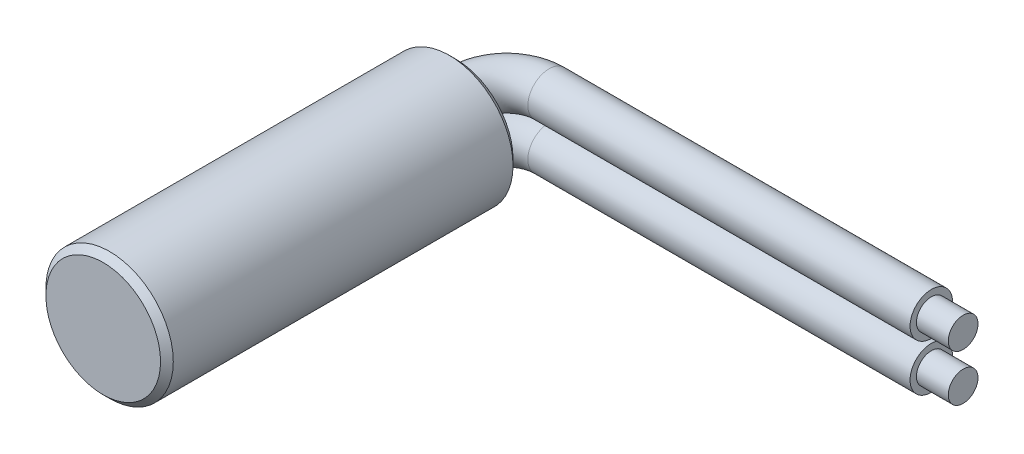
ISO-10303-21;
HEADER;
FILE_DESCRIPTION(('STEP AP214'),'2;1');
FILE_NAME('part.step','',(''),(''),'','','');
FILE_SCHEMA(('AUTOMOTIVE_DESIGN { 1 0 10303 214 1 1 1 1 }'));
ENDSEC;
DATA;
#1=APPLICATION_CONTEXT('core data for automotive mechanical design processes');
#2=APPLICATION_PROTOCOL_DEFINITION('international standard','automotive_design',2000,#1);
#3=PRODUCT_CONTEXT('',#1,'mechanical');
#4=PRODUCT('Part','Part','',(#3));
#5=PRODUCT_RELATED_PRODUCT_CATEGORY('part','',(#4));
#6=PRODUCT_DEFINITION_FORMATION('','',#4);
#7=PRODUCT_DEFINITION_CONTEXT('part definition',#1,'design');
#8=PRODUCT_DEFINITION('design','',#6,#7);
#9=PRODUCT_DEFINITION_SHAPE('','',#8);
#10=(LENGTH_UNIT() NAMED_UNIT(*) SI_UNIT(.MILLI.,.METRE.));
#11=(NAMED_UNIT(*) PLANE_ANGLE_UNIT() SI_UNIT($,.RADIAN.));
#12=(NAMED_UNIT(*) SI_UNIT($,.STERADIAN.) SOLID_ANGLE_UNIT());
#13=UNCERTAINTY_MEASURE_WITH_UNIT(LENGTH_MEASURE(1.E-05),#10,'distance_accuracy_value','');
#14=(GEOMETRIC_REPRESENTATION_CONTEXT(3) GLOBAL_UNCERTAINTY_ASSIGNED_CONTEXT((#13)) GLOBAL_UNIT_ASSIGNED_CONTEXT((#10,
#11,#12)) REPRESENTATION_CONTEXT('',''));
#15=CARTESIAN_POINT('',(0.,0.,0.));
#16=DIRECTION('',(0.,0.,1.));
#17=DIRECTION('',(1.,0.,0.));
#18=AXIS2_PLACEMENT_3D('',#15,#16,#17);
#19=CARTESIAN_POINT('',(0.,0.,16.6));
#20=DIRECTION('',(0.,0.,-1.));
#21=DIRECTION('',(-1.,0.,0.));
#22=AXIS2_PLACEMENT_3D('',#19,#20,#21);
#23=CYLINDRICAL_SURFACE('',#22,3.);
#24=CARTESIAN_POINT('',(0.,0.,0.300000000000009));
#25=DIRECTION('',(0.,0.,1.));
#26=DIRECTION('',(1.,0.,0.));
#27=AXIS2_PLACEMENT_3D('',#24,#25,#26);
#28=CIRCLE('',#27,3.);
#29=CARTESIAN_POINT('',(3.,0.,0.300000000000009));
#30=VERTEX_POINT('',#29);
#31=EDGE_CURVE('E77',#30,#30,#28,.T.);
#32=ORIENTED_EDGE('',*,*,#31,.T.);
#33=EDGE_LOOP('',(#32));
#34=FACE_BOUND('',#33,.T.);
#35=CARTESIAN_POINT('',(0.,0.,16.3));
#36=DIRECTION('',(0.,0.,1.));
#37=DIRECTION('',(1.,0.,0.));
#38=AXIS2_PLACEMENT_3D('',#35,#36,#37);
#39=CIRCLE('',#38,3.);
#40=CARTESIAN_POINT('',(3.,0.,16.3));
#41=VERTEX_POINT('',#40);
#42=EDGE_CURVE('E74',#41,#41,#39,.F.);
#43=ORIENTED_EDGE('',*,*,#42,.T.);
#44=EDGE_LOOP('',(#43));
#45=FACE_BOUND('',#44,.T.);
#46=ADVANCED_FACE('F35',(#34,#45),#23,.T.);
#47=CARTESIAN_POINT('',(0.,0.,16.6));
#48=DIRECTION('',(0.,0.,1.));
#49=DIRECTION('',(1.,0.,0.));
#50=AXIS2_PLACEMENT_3D('',#47,#48,#49);
#51=PLANE('',#50);
#52=CARTESIAN_POINT('',(0.,0.,16.6));
#53=DIRECTION('',(0.,0.,1.));
#54=DIRECTION('',(1.,0.,0.));
#55=AXIS2_PLACEMENT_3D('',#52,#53,#54);
#56=CIRCLE('',#55,2.70000000000001);
#57=CARTESIAN_POINT('',(2.70000000000001,0.,16.6));
#58=VERTEX_POINT('',#57);
#59=EDGE_CURVE('E39',#58,#58,#56,.T.);
#60=ORIENTED_EDGE('',*,*,#59,.T.);
#61=EDGE_LOOP('',(#60));
#62=FACE_BOUND('',#61,.T.);
#63=ADVANCED_FACE('F110',(#62),#51,.T.);
#64=CARTESIAN_POINT('',(0.,0.,0.));
#65=DIRECTION('',(0.,0.,1.));
#66=DIRECTION('',(1.,0.,0.));
#67=AXIS2_PLACEMENT_3D('',#64,#65,#66);
#68=PLANE('',#67);
#69=CARTESIAN_POINT('',(0.,1.1,0.));
#70=DIRECTION('',(0.,0.,-1.));
#71=DIRECTION('',(-1.,0.,0.));
#72=AXIS2_PLACEMENT_3D('',#69,#70,#71);
#73=CIRCLE('',#72,1.);
#74=CARTESIAN_POINT('',(-1.,1.1,0.));
#75=VERTEX_POINT('',#74);
#76=EDGE_CURVE('E93',#75,#75,#73,.T.);
#77=ORIENTED_EDGE('',*,*,#76,.F.);
#78=EDGE_LOOP('',(#77));
#79=FACE_BOUND('',#78,.T.);
#80=CARTESIAN_POINT('',(0.,-1.1,0.));
#81=DIRECTION('',(0.,0.,-1.));
#82=DIRECTION('',(-1.,0.,0.));
#83=AXIS2_PLACEMENT_3D('',#80,#81,#82);
#84=CIRCLE('',#83,1.);
#85=CARTESIAN_POINT('',(-1.,-1.1,0.));
#86=VERTEX_POINT('',#85);
#87=EDGE_CURVE('E57',#86,#86,#84,.T.);
#88=ORIENTED_EDGE('',*,*,#87,.F.);
#89=EDGE_LOOP('',(#88));
#90=FACE_BOUND('',#89,.T.);
#91=CARTESIAN_POINT('',(0.,0.,0.));
#92=DIRECTION('',(0.,0.,1.));
#93=DIRECTION('',(1.,0.,0.));
#94=AXIS2_PLACEMENT_3D('',#91,#92,#93);
#95=CIRCLE('',#94,2.69999999999999);
#96=CARTESIAN_POINT('',(2.69999999999999,0.,0.));
#97=VERTEX_POINT('',#96);
#98=EDGE_CURVE('E79',#97,#97,#95,.F.);
#99=ORIENTED_EDGE('',*,*,#98,.T.);
#100=EDGE_LOOP('',(#99));
#101=FACE_BOUND('',#100,.T.);
#102=ADVANCED_FACE('F106',(#79,#90,#101),#68,.F.);
#103=CARTESIAN_POINT('',(0.,0.,0.300000000000009));
#104=DIRECTION('',(0.,0.,1.));
#105=DIRECTION('',(1.,0.,0.));
#106=AXIS2_PLACEMENT_3D('',#103,#104,#105);
#107=CONICAL_SURFACE('',#106,3.,0.785398163397454);
#108=ORIENTED_EDGE('',*,*,#98,.F.);
#109=EDGE_LOOP('',(#108));
#110=FACE_BOUND('',#109,.T.);
#111=ORIENTED_EDGE('',*,*,#31,.F.);
#112=EDGE_LOOP('',(#111));
#113=FACE_BOUND('',#112,.T.);
#114=ADVANCED_FACE('F109',(#110,#113),#107,.T.);
#115=CARTESIAN_POINT('',(0.,0.,16.6));
#116=DIRECTION('',(0.,0.,-1.));
#117=DIRECTION('',(-1.,0.,0.));
#118=AXIS2_PLACEMENT_3D('',#115,#116,#117);
#119=CONICAL_SURFACE('',#118,2.70000000000001,0.785398163397443);
#120=ORIENTED_EDGE('',*,*,#42,.F.);
#121=EDGE_LOOP('',(#120));
#122=FACE_BOUND('',#121,.T.);
#123=ORIENTED_EDGE('',*,*,#59,.F.);
#124=EDGE_LOOP('',(#123));
#125=FACE_BOUND('',#124,.T.);
#126=ADVANCED_FACE('F37',(#122,#125),#119,.T.);
#127=CARTESIAN_POINT('',(20.,-1.1,-2.4));
#128=DIRECTION('',(1.,0.,0.));
#129=DIRECTION('',(0.,0.,-1.));
#130=AXIS2_PLACEMENT_3D('',#127,#128,#129);
#131=PLANE('',#130);
#132=CARTESIAN_POINT('',(20.,-1.1,-2.4));
#133=DIRECTION('',(1.,0.,0.));
#134=DIRECTION('',(0.,0.,-1.));
#135=AXIS2_PLACEMENT_3D('',#132,#133,#134);
#136=CIRCLE('',#135,0.7);
#137=CARTESIAN_POINT('',(20.,-1.1,-3.1));
#138=VERTEX_POINT('',#137);
#139=EDGE_CURVE('E11',#138,#138,#136,.T.);
#140=ORIENTED_EDGE('',*,*,#139,.F.);
#141=EDGE_LOOP('',(#140));
#142=FACE_BOUND('',#141,.T.);
#143=CARTESIAN_POINT('',(20.,-1.1,-2.4));
#144=DIRECTION('',(1.,0.,0.));
#145=DIRECTION('',(0.,0.,-1.));
#146=AXIS2_PLACEMENT_3D('',#143,#144,#145);
#147=CIRCLE('',#146,1.);
#148=CARTESIAN_POINT('',(20.,-1.1,-3.4));
#149=VERTEX_POINT('',#148);
#150=EDGE_CURVE('E50',#149,#149,#147,.T.);
#151=ORIENTED_EDGE('',*,*,#150,.T.);
#152=EDGE_LOOP('',(#151));
#153=FACE_BOUND('',#152,.T.);
#154=ADVANCED_FACE('F117',(#142,#153),#131,.T.);
#155=CARTESIAN_POINT('',(0.,-1.1,0.));
#156=DIRECTION('',(0.,0.,-1.));
#157=DIRECTION('',(-1.,0.,0.));
#158=AXIS2_PLACEMENT_3D('',#155,#156,#157);
#159=CYLINDRICAL_SURFACE('',#158,1.);
#160=CARTESIAN_POINT('',(0.,-1.1,-0.4));
#161=DIRECTION('',(0.,0.,-1.));
#162=DIRECTION('',(-1.,0.,0.));
#163=AXIS2_PLACEMENT_3D('',#160,#161,#162);
#164=CIRCLE('',#163,1.);
#165=CARTESIAN_POINT('',(-1.,-1.1,-0.4));
#166=VERTEX_POINT('',#165);
#167=EDGE_CURVE('E61',#166,#166,#164,.T.);
#168=ORIENTED_EDGE('',*,*,#167,.F.);
#169=EDGE_LOOP('',(#168));
#170=FACE_BOUND('',#169,.T.);
#171=ORIENTED_EDGE('',*,*,#87,.T.);
#172=EDGE_LOOP('',(#171));
#173=FACE_BOUND('',#172,.T.);
#174=ADVANCED_FACE('F114',(#170,#173),#159,.T.);
#175=CARTESIAN_POINT('',(2.,-1.1,-0.4));
#176=DIRECTION('',(0.,-1.,0.));
#177=DIRECTION('',(0.,0.,-1.));
#178=AXIS2_PLACEMENT_3D('',#175,#176,#177);
#179=TOROIDAL_SURFACE('',#178,2.,1.);
#180=CARTESIAN_POINT('',(2.,-1.1,-2.4));
#181=DIRECTION('',(1.,0.,0.));
#182=DIRECTION('',(0.,0.,-1.));
#183=AXIS2_PLACEMENT_3D('',#180,#181,#182);
#184=CIRCLE('',#183,1.);
#185=CARTESIAN_POINT('',(2.,-1.1,-3.4));
#186=VERTEX_POINT('',#185);
#187=EDGE_CURVE('E70',#186,#186,#184,.T.);
#188=CARTESIAN_POINT('',(2.,-1.1,-0.4));
#189=DIRECTION('',(0.,-1.,0.));
#190=DIRECTION('',(0.,0.,-1.));
#191=AXIS2_PLACEMENT_3D('',#188,#189,#190);
#192=CIRCLE('',#191,3.);
#193=EDGE_CURVE('',#166,#186,#192,.T.);
#194=ORIENTED_EDGE('',*,*,#167,.T.);
#195=ORIENTED_EDGE('',*,*,#187,.F.);
#196=ORIENTED_EDGE('',*,*,#193,.T.);
#197=ORIENTED_EDGE('',*,*,#193,.F.);
#198=EDGE_LOOP('',(#194,#196,#195,#197));
#199=FACE_BOUND('',#198,.T.);
#200=ADVANCED_FACE('F116',(#199),#179,.T.);
#201=CARTESIAN_POINT('',(2.,-1.1,-2.4));
#202=DIRECTION('',(1.,0.,0.));
#203=DIRECTION('',(0.,0.,-1.));
#204=AXIS2_PLACEMENT_3D('',#201,#202,#203);
#205=CYLINDRICAL_SURFACE('',#204,1.);
#206=ORIENTED_EDGE('',*,*,#150,.F.);
#207=EDGE_LOOP('',(#206));
#208=FACE_BOUND('',#207,.T.);
#209=ORIENTED_EDGE('',*,*,#187,.T.);
#210=EDGE_LOOP('',(#209));
#211=FACE_BOUND('',#210,.T.);
#212=ADVANCED_FACE('F124',(#208,#211),#205,.T.);
#213=CARTESIAN_POINT('',(20.,1.1,-2.4));
#214=DIRECTION('',(1.,0.,0.));
#215=DIRECTION('',(0.,0.,-1.));
#216=AXIS2_PLACEMENT_3D('',#213,#214,#215);
#217=PLANE('',#216);
#218=CARTESIAN_POINT('',(20.,1.1,-2.4));
#219=DIRECTION('',(1.,0.,0.));
#220=DIRECTION('',(0.,0.,-1.));
#221=AXIS2_PLACEMENT_3D('',#218,#219,#220);
#222=CIRCLE('',#221,0.7);
#223=CARTESIAN_POINT('',(20.,1.1,-3.1));
#224=VERTEX_POINT('',#223);
#225=EDGE_CURVE('E44',#224,#224,#222,.T.);
#226=ORIENTED_EDGE('',*,*,#225,.F.);
#227=EDGE_LOOP('',(#226));
#228=FACE_BOUND('',#227,.T.);
#229=CARTESIAN_POINT('',(20.,1.1,-2.4));
#230=DIRECTION('',(1.,0.,0.));
#231=DIRECTION('',(0.,0.,-1.));
#232=AXIS2_PLACEMENT_3D('',#229,#230,#231);
#233=CIRCLE('',#232,1.);
#234=CARTESIAN_POINT('',(20.,1.1,-3.4));
#235=VERTEX_POINT('',#234);
#236=EDGE_CURVE('E54',#235,#235,#233,.T.);
#237=ORIENTED_EDGE('',*,*,#236,.T.);
#238=EDGE_LOOP('',(#237));
#239=FACE_BOUND('',#238,.T.);
#240=ADVANCED_FACE('F55',(#228,#239),#217,.T.);
#241=CARTESIAN_POINT('',(0.,1.1,0.));
#242=DIRECTION('',(0.,0.,-1.));
#243=DIRECTION('',(-1.,0.,0.));
#244=AXIS2_PLACEMENT_3D('',#241,#242,#243);
#245=CYLINDRICAL_SURFACE('',#244,1.);
#246=CARTESIAN_POINT('',(0.,1.1,-0.4));
#247=DIRECTION('',(0.,0.,-1.));
#248=DIRECTION('',(-1.,0.,0.));
#249=AXIS2_PLACEMENT_3D('',#246,#247,#248);
#250=CIRCLE('',#249,1.);
#251=CARTESIAN_POINT('',(-1.,1.1,-0.4));
#252=VERTEX_POINT('',#251);
#253=EDGE_CURVE('E64',#252,#252,#250,.T.);
#254=ORIENTED_EDGE('',*,*,#253,.F.);
#255=EDGE_LOOP('',(#254));
#256=FACE_BOUND('',#255,.T.);
#257=ORIENTED_EDGE('',*,*,#76,.T.);
#258=EDGE_LOOP('',(#257));
#259=FACE_BOUND('',#258,.T.);
#260=ADVANCED_FACE('F100',(#256,#259),#245,.T.);
#261=CARTESIAN_POINT('',(2.,1.1,-0.4));
#262=DIRECTION('',(0.,-1.,0.));
#263=DIRECTION('',(0.,0.,-1.));
#264=AXIS2_PLACEMENT_3D('',#261,#262,#263);
#265=TOROIDAL_SURFACE('',#264,2.,1.);
#266=CARTESIAN_POINT('',(2.,1.1,-2.4));
#267=DIRECTION('',(1.,0.,0.));
#268=DIRECTION('',(0.,0.,-1.));
#269=AXIS2_PLACEMENT_3D('',#266,#267,#268);
#270=CIRCLE('',#269,1.);
#271=CARTESIAN_POINT('',(2.,1.1,-3.4));
#272=VERTEX_POINT('',#271);
#273=EDGE_CURVE('E58',#272,#272,#270,.T.);
#274=CARTESIAN_POINT('',(2.,1.1,-0.4));
#275=DIRECTION('',(0.,-1.,0.));
#276=DIRECTION('',(0.,0.,-1.));
#277=AXIS2_PLACEMENT_3D('',#274,#275,#276);
#278=CIRCLE('',#277,3.);
#279=EDGE_CURVE('',#252,#272,#278,.T.);
#280=ORIENTED_EDGE('',*,*,#253,.T.);
#281=ORIENTED_EDGE('',*,*,#273,.F.);
#282=ORIENTED_EDGE('',*,*,#279,.T.);
#283=ORIENTED_EDGE('',*,*,#279,.F.);
#284=EDGE_LOOP('',(#280,#282,#281,#283));
#285=FACE_BOUND('',#284,.T.);
#286=ADVANCED_FACE('F98',(#285),#265,.T.);
#287=CARTESIAN_POINT('',(2.,1.1,-2.4));
#288=DIRECTION('',(1.,0.,0.));
#289=DIRECTION('',(0.,0.,-1.));
#290=AXIS2_PLACEMENT_3D('',#287,#288,#289);
#291=CYLINDRICAL_SURFACE('',#290,1.);
#292=ORIENTED_EDGE('',*,*,#236,.F.);
#293=EDGE_LOOP('',(#292));
#294=FACE_BOUND('',#293,.T.);
#295=ORIENTED_EDGE('',*,*,#273,.T.);
#296=EDGE_LOOP('',(#295));
#297=FACE_BOUND('',#296,.T.);
#298=ADVANCED_FACE('F129',(#294,#297),#291,.T.);
#299=CARTESIAN_POINT('',(21.5,1.1,-2.4));
#300=DIRECTION('',(-1.,0.,0.));
#301=DIRECTION('',(0.,0.,1.));
#302=AXIS2_PLACEMENT_3D('',#299,#300,#301);
#303=CYLINDRICAL_SURFACE('',#302,0.7);
#304=CARTESIAN_POINT('',(21.5,1.1,-2.4));
#305=DIRECTION('',(1.,0.,0.));
#306=DIRECTION('',(0.,0.,-1.));
#307=AXIS2_PLACEMENT_3D('',#304,#305,#306);
#308=CIRCLE('',#307,0.7);
#309=CARTESIAN_POINT('',(21.5,1.1,-3.1));
#310=VERTEX_POINT('',#309);
#311=EDGE_CURVE('E92',#310,#310,#308,.T.);
#312=ORIENTED_EDGE('',*,*,#311,.F.);
#313=EDGE_LOOP('',(#312));
#314=FACE_BOUND('',#313,.T.);
#315=ORIENTED_EDGE('',*,*,#225,.T.);
#316=EDGE_LOOP('',(#315));
#317=FACE_BOUND('',#316,.T.);
#318=ADVANCED_FACE('F159',(#314,#317),#303,.T.);
#319=CARTESIAN_POINT('',(21.5,1.1,-2.4));
#320=DIRECTION('',(1.,0.,0.));
#321=DIRECTION('',(0.,0.,-1.));
#322=AXIS2_PLACEMENT_3D('',#319,#320,#321);
#323=PLANE('',#322);
#324=ORIENTED_EDGE('',*,*,#311,.T.);
#325=EDGE_LOOP('',(#324));
#326=FACE_BOUND('',#325,.T.);
#327=ADVANCED_FACE('F167',(#326),#323,.T.);
#328=CARTESIAN_POINT('',(21.5,-1.1,-2.4));
#329=DIRECTION('',(-1.,0.,0.));
#330=DIRECTION('',(0.,0.,1.));
#331=AXIS2_PLACEMENT_3D('',#328,#329,#330);
#332=CYLINDRICAL_SURFACE('',#331,0.7);
#333=CARTESIAN_POINT('',(21.5,-1.1,-2.4));
#334=DIRECTION('',(1.,0.,0.));
#335=DIRECTION('',(0.,0.,-1.));
#336=AXIS2_PLACEMENT_3D('',#333,#334,#335);
#337=CIRCLE('',#336,0.7);
#338=CARTESIAN_POINT('',(21.5,-1.1,-3.1));
#339=VERTEX_POINT('',#338);
#340=EDGE_CURVE('E240',#339,#339,#337,.T.);
#341=ORIENTED_EDGE('',*,*,#340,.F.);
#342=EDGE_LOOP('',(#341));
#343=FACE_BOUND('',#342,.T.);
#344=ORIENTED_EDGE('',*,*,#139,.T.);
#345=EDGE_LOOP('',(#344));
#346=FACE_BOUND('',#345,.T.);
#347=ADVANCED_FACE('F174',(#343,#346),#332,.T.);
#348=CARTESIAN_POINT('',(21.5,-1.1,-2.4));
#349=DIRECTION('',(1.,0.,0.));
#350=DIRECTION('',(0.,0.,-1.));
#351=AXIS2_PLACEMENT_3D('',#348,#349,#350);
#352=PLANE('',#351);
#353=ORIENTED_EDGE('',*,*,#340,.T.);
#354=EDGE_LOOP('',(#353));
#355=FACE_BOUND('',#354,.T.);
#356=ADVANCED_FACE('F225',(#355),#352,.T.);
#357=CLOSED_SHELL('',(#46,#63,#102,#114,#126,#154,#174,#200,#212,#240,#260,#286,#298,#318,#327,
#347,#356));
#358=MANIFOLD_SOLID_BREP('B2',#357);
#359=ADVANCED_BREP_SHAPE_REPRESENTATION('',(#18,#358),#14);
#360=SHAPE_DEFINITION_REPRESENTATION(#9,#359);
ENDSEC;
END-ISO-10303-21;
